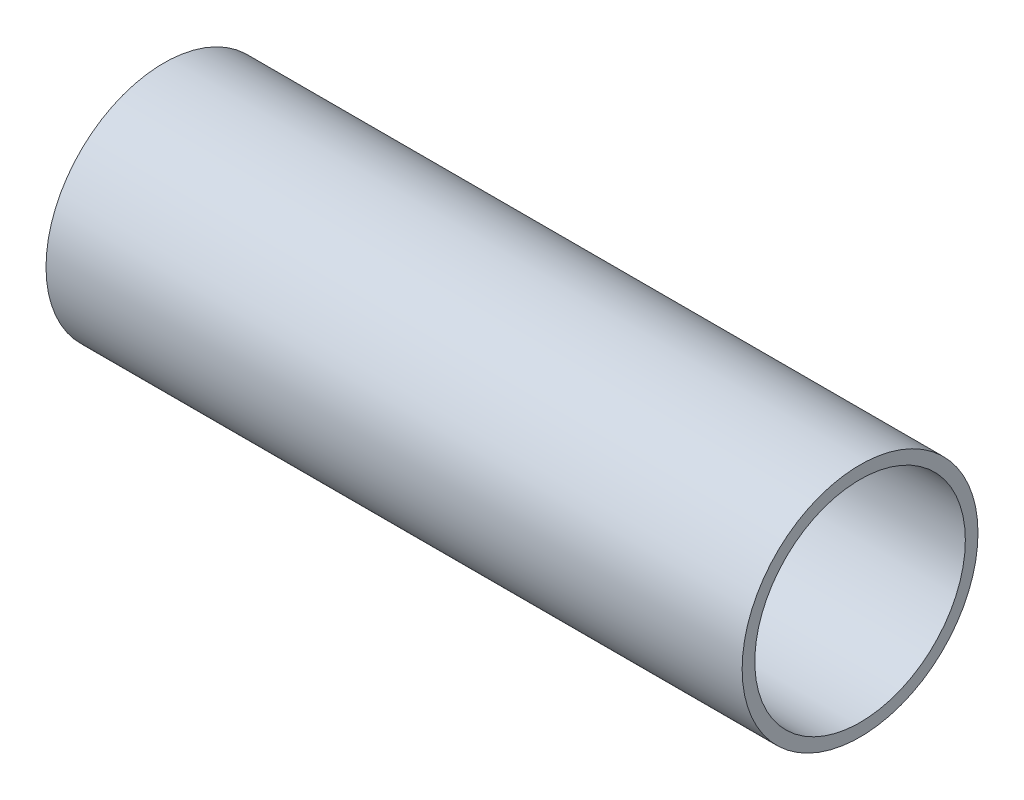
ISO-10303-21;
HEADER;
FILE_DESCRIPTION(('STEP AP214'),'2;1');
FILE_NAME('part.step','',(''),(''),'','','');
FILE_SCHEMA(('AUTOMOTIVE_DESIGN { 1 0 10303 214 1 1 1 1 }'));
ENDSEC;
DATA;
#1=APPLICATION_CONTEXT('core data for automotive mechanical design processes');
#2=APPLICATION_PROTOCOL_DEFINITION('international standard','automotive_design',2000,#1);
#3=PRODUCT_CONTEXT('',#1,'mechanical');
#4=PRODUCT('Part','Part','',(#3));
#5=PRODUCT_RELATED_PRODUCT_CATEGORY('part','',(#4));
#6=PRODUCT_DEFINITION_FORMATION('','',#4);
#7=PRODUCT_DEFINITION_CONTEXT('part definition',#1,'design');
#8=PRODUCT_DEFINITION('design','',#6,#7);
#9=PRODUCT_DEFINITION_SHAPE('','',#8);
#10=(LENGTH_UNIT() NAMED_UNIT(*) SI_UNIT(.MILLI.,.METRE.));
#11=(NAMED_UNIT(*) PLANE_ANGLE_UNIT() SI_UNIT($,.RADIAN.));
#12=(NAMED_UNIT(*) SI_UNIT($,.STERADIAN.) SOLID_ANGLE_UNIT());
#13=UNCERTAINTY_MEASURE_WITH_UNIT(LENGTH_MEASURE(1.E-05),#10,'distance_accuracy_value','');
#14=(GEOMETRIC_REPRESENTATION_CONTEXT(3) GLOBAL_UNCERTAINTY_ASSIGNED_CONTEXT((#13)) GLOBAL_UNIT_ASSIGNED_CONTEXT((#10,
#11,#12)) REPRESENTATION_CONTEXT('',''));
#15=CARTESIAN_POINT('',(0.,0.,0.));
#16=DIRECTION('',(0.,0.,1.));
#17=DIRECTION('',(1.,0.,0.));
#18=AXIS2_PLACEMENT_3D('',#15,#16,#17);
#19=CARTESIAN_POINT('',(550.,0.,0.));
#20=DIRECTION('',(-1.,0.,0.));
#21=DIRECTION('',(0.,0.,1.));
#22=AXIS2_PLACEMENT_3D('',#19,#20,#21);
#23=CYLINDRICAL_SURFACE('',#22,93.17284);
#24=CARTESIAN_POINT('',(550.,0.,0.));
#25=DIRECTION('',(1.,0.,0.));
#26=DIRECTION('',(0.,0.,-1.));
#27=AXIS2_PLACEMENT_3D('',#24,#25,#26);
#28=CIRCLE('',#27,93.17284);
#29=CARTESIAN_POINT('',(550.,0.,-93.17284));
#30=VERTEX_POINT('',#29);
#31=EDGE_CURVE('E10',#30,#30,#28,.T.);
#32=ORIENTED_EDGE('',*,*,#31,.F.);
#33=EDGE_LOOP('',(#32));
#34=FACE_BOUND('',#33,.T.);
#35=CARTESIAN_POINT('',(0.,0.,0.));
#36=DIRECTION('',(1.,0.,0.));
#37=DIRECTION('',(0.,0.,-1.));
#38=AXIS2_PLACEMENT_3D('',#35,#36,#37);
#39=CIRCLE('',#38,93.17284);
#40=CARTESIAN_POINT('',(0.,0.,-93.17284));
#41=VERTEX_POINT('',#40);
#42=EDGE_CURVE('E35',#41,#41,#39,.T.);
#43=ORIENTED_EDGE('',*,*,#42,.T.);
#44=EDGE_LOOP('',(#43));
#45=FACE_BOUND('',#44,.T.);
#46=ADVANCED_FACE('F32',(#34,#45),#23,.T.);
#47=CARTESIAN_POINT('',(550.,0.,0.));
#48=DIRECTION('',(1.,0.,0.));
#49=DIRECTION('',(0.,0.,-1.));
#50=AXIS2_PLACEMENT_3D('',#47,#48,#49);
#51=PLANE('',#50);
#52=CARTESIAN_POINT('',(550.,0.,0.));
#53=DIRECTION('',(1.,0.,0.));
#54=DIRECTION('',(0.,0.,-1.));
#55=AXIS2_PLACEMENT_3D('',#52,#53,#54);
#56=CIRCLE('',#55,83.17284);
#57=CARTESIAN_POINT('',(550.,0.,-83.17284));
#58=VERTEX_POINT('',#57);
#59=EDGE_CURVE('E44',#58,#58,#56,.T.);
#60=ORIENTED_EDGE('',*,*,#59,.F.);
#61=EDGE_LOOP('',(#60));
#62=FACE_BOUND('',#61,.T.);
#63=ORIENTED_EDGE('',*,*,#31,.T.);
#64=EDGE_LOOP('',(#63));
#65=FACE_BOUND('',#64,.T.);
#66=ADVANCED_FACE('F59',(#62,#65),#51,.T.);
#67=CARTESIAN_POINT('',(0.,0.,0.));
#68=DIRECTION('',(1.,0.,0.));
#69=DIRECTION('',(0.,0.,-1.));
#70=AXIS2_PLACEMENT_3D('',#67,#68,#69);
#71=PLANE('',#70);
#72=CARTESIAN_POINT('',(0.,0.,0.));
#73=DIRECTION('',(1.,0.,0.));
#74=DIRECTION('',(0.,0.,-1.));
#75=AXIS2_PLACEMENT_3D('',#72,#73,#74);
#76=CIRCLE('',#75,83.17284);
#77=CARTESIAN_POINT('',(0.,0.,-83.17284));
#78=VERTEX_POINT('',#77);
#79=EDGE_CURVE('E42',#78,#78,#76,.T.);
#80=ORIENTED_EDGE('',*,*,#79,.T.);
#81=EDGE_LOOP('',(#80));
#82=FACE_BOUND('',#81,.T.);
#83=ORIENTED_EDGE('',*,*,#42,.F.);
#84=EDGE_LOOP('',(#83));
#85=FACE_BOUND('',#84,.T.);
#86=ADVANCED_FACE('F50',(#82,#85),#71,.F.);
#87=CARTESIAN_POINT('',(0.,0.,0.));
#88=DIRECTION('',(1.,0.,0.));
#89=DIRECTION('',(0.,0.,-1.));
#90=AXIS2_PLACEMENT_3D('',#87,#88,#89);
#91=CYLINDRICAL_SURFACE('',#90,83.17284);
#92=ORIENTED_EDGE('',*,*,#79,.F.);
#93=EDGE_LOOP('',(#92));
#94=FACE_BOUND('',#93,.T.);
#95=ORIENTED_EDGE('',*,*,#59,.T.);
#96=EDGE_LOOP('',(#95));
#97=FACE_BOUND('',#96,.T.);
#98=ADVANCED_FACE('F53',(#94,#97),#91,.F.);
#99=CLOSED_SHELL('',(#46,#66,#86,#98));
#100=MANIFOLD_SOLID_BREP('B2',#99);
#101=ADVANCED_BREP_SHAPE_REPRESENTATION('',(#18,#100),#14);
#102=SHAPE_DEFINITION_REPRESENTATION(#9,#101);
ENDSEC;
END-ISO-10303-21;
